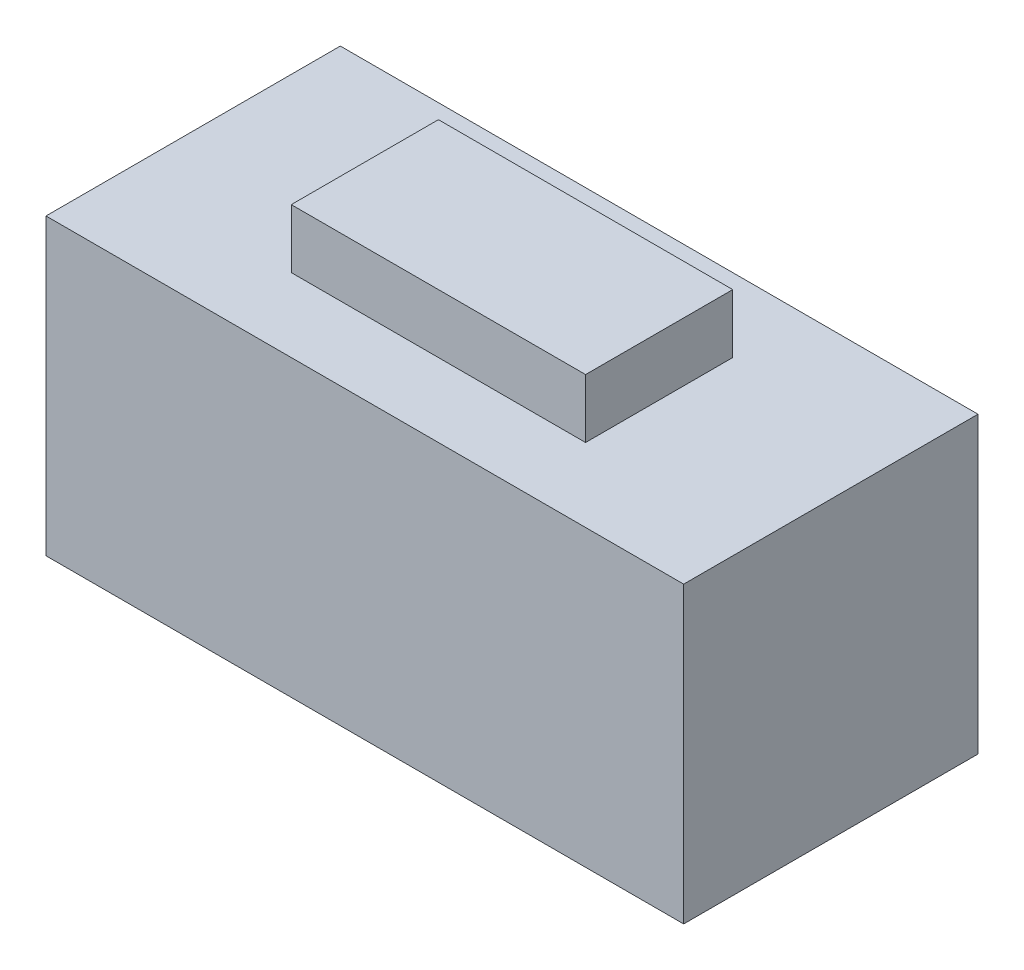
ISO-10303-21;
HEADER;
FILE_DESCRIPTION(('STEP AP214'),'2;1');
FILE_NAME('part.step','',(''),(''),'','','');
FILE_SCHEMA(('AUTOMOTIVE_DESIGN { 1 0 10303 214 1 1 1 1 }'));
ENDSEC;
DATA;
#1=APPLICATION_CONTEXT('core data for automotive mechanical design processes');
#2=APPLICATION_PROTOCOL_DEFINITION('international standard','automotive_design',2000,#1);
#3=PRODUCT_CONTEXT('',#1,'mechanical');
#4=PRODUCT('Part','Part','',(#3));
#5=PRODUCT_RELATED_PRODUCT_CATEGORY('part','',(#4));
#6=PRODUCT_DEFINITION_FORMATION('','',#4);
#7=PRODUCT_DEFINITION_CONTEXT('part definition',#1,'design');
#8=PRODUCT_DEFINITION('design','',#6,#7);
#9=PRODUCT_DEFINITION_SHAPE('','',#8);
#10=(LENGTH_UNIT() NAMED_UNIT(*) SI_UNIT(.MILLI.,.METRE.));
#11=(NAMED_UNIT(*) PLANE_ANGLE_UNIT() SI_UNIT($,.RADIAN.));
#12=(NAMED_UNIT(*) SI_UNIT($,.STERADIAN.) SOLID_ANGLE_UNIT());
#13=UNCERTAINTY_MEASURE_WITH_UNIT(LENGTH_MEASURE(1.E-05),#10,'distance_accuracy_value','');
#14=(GEOMETRIC_REPRESENTATION_CONTEXT(3) GLOBAL_UNCERTAINTY_ASSIGNED_CONTEXT((#13)) GLOBAL_UNIT_ASSIGNED_CONTEXT((#10,
#11,#12)) REPRESENTATION_CONTEXT('',''));
#15=CARTESIAN_POINT('',(0.,0.,0.));
#16=DIRECTION('',(0.,0.,1.));
#17=DIRECTION('',(1.,0.,0.));
#18=AXIS2_PLACEMENT_3D('',#15,#16,#17);
#19=CARTESIAN_POINT('',(-3.25,3.,1.5));
#20=DIRECTION('',(1.,0.,0.));
#21=DIRECTION('',(0.,0.,-1.));
#22=AXIS2_PLACEMENT_3D('',#19,#20,#21);
#23=PLANE('',#22);
#24=DIRECTION('',(0.,0.,1.));
#25=VECTOR('',#24,1.);
#26=CARTESIAN_POINT('',(-3.25,0.,1.5));
#27=LINE('',#26,#25);
#28=CARTESIAN_POINT('',(-3.25,0.,-1.5));
#29=VERTEX_POINT('',#28);
#30=CARTESIAN_POINT('',(-3.25,0.,1.5));
#31=VERTEX_POINT('',#30);
#32=EDGE_CURVE('E120',#29,#31,#27,.T.);
#33=ORIENTED_EDGE('',*,*,#32,.T.);
#34=DIRECTION('',(0.,-1.,0.));
#35=VECTOR('',#34,1.);
#36=CARTESIAN_POINT('',(-3.25,3.,1.5));
#37=LINE('',#36,#35);
#38=CARTESIAN_POINT('',(-3.25,3.,1.5));
#39=VERTEX_POINT('',#38);
#40=EDGE_CURVE('E11',#39,#31,#37,.T.);
#41=ORIENTED_EDGE('',*,*,#40,.F.);
#42=DIRECTION('',(0.,0.,1.));
#43=VECTOR('',#42,1.);
#44=CARTESIAN_POINT('',(-3.25,3.,1.5));
#45=LINE('',#44,#43);
#46=CARTESIAN_POINT('',(-3.25,3.,-1.5));
#47=VERTEX_POINT('',#46);
#48=EDGE_CURVE('E129',#47,#39,#45,.T.);
#49=ORIENTED_EDGE('',*,*,#48,.F.);
#50=DIRECTION('',(0.,-1.,0.));
#51=VECTOR('',#50,1.);
#52=CARTESIAN_POINT('',(-3.25,3.,-1.5));
#53=LINE('',#52,#51);
#54=EDGE_CURVE('E138',#47,#29,#53,.T.);
#55=ORIENTED_EDGE('',*,*,#54,.T.);
#56=EDGE_LOOP('',(#33,#41,#49,#55));
#57=FACE_BOUND('',#56,.T.);
#58=ADVANCED_FACE('F36',(#57),#23,.F.);
#59=CARTESIAN_POINT('',(3.25,3.,1.5));
#60=DIRECTION('',(0.,0.,-1.));
#61=DIRECTION('',(-1.,0.,0.));
#62=AXIS2_PLACEMENT_3D('',#59,#60,#61);
#63=PLANE('',#62);
#64=DIRECTION('',(1.,0.,0.));
#65=VECTOR('',#64,1.);
#66=CARTESIAN_POINT('',(3.25,0.,1.5));
#67=LINE('',#66,#65);
#68=CARTESIAN_POINT('',(3.25,0.,1.5));
#69=VERTEX_POINT('',#68);
#70=EDGE_CURVE('E123',#31,#69,#67,.T.);
#71=ORIENTED_EDGE('',*,*,#70,.T.);
#72=DIRECTION('',(0.,-1.,0.));
#73=VECTOR('',#72,1.);
#74=CARTESIAN_POINT('',(3.25,3.,1.5));
#75=LINE('',#74,#73);
#76=CARTESIAN_POINT('',(3.25,3.,1.5));
#77=VERTEX_POINT('',#76);
#78=EDGE_CURVE('E43',#77,#69,#75,.T.);
#79=ORIENTED_EDGE('',*,*,#78,.F.);
#80=DIRECTION('',(1.,0.,0.));
#81=VECTOR('',#80,1.);
#82=CARTESIAN_POINT('',(3.25,3.,1.5));
#83=LINE('',#82,#81);
#84=EDGE_CURVE('E132',#39,#77,#83,.T.);
#85=ORIENTED_EDGE('',*,*,#84,.F.);
#86=ORIENTED_EDGE('',*,*,#40,.T.);
#87=EDGE_LOOP('',(#71,#79,#85,#86));
#88=FACE_BOUND('',#87,.T.);
#89=ADVANCED_FACE('F169',(#88),#63,.F.);
#90=CARTESIAN_POINT('',(3.25,3.,1.5));
#91=DIRECTION('',(-1.,0.,0.));
#92=DIRECTION('',(0.,0.,1.));
#93=AXIS2_PLACEMENT_3D('',#90,#91,#92);
#94=PLANE('',#93);
#95=DIRECTION('',(0.,0.,-1.));
#96=VECTOR('',#95,1.);
#97=CARTESIAN_POINT('',(3.25,0.,1.5));
#98=LINE('',#97,#96);
#99=CARTESIAN_POINT('',(3.25,0.,-1.5));
#100=VERTEX_POINT('',#99);
#101=EDGE_CURVE('E141',#69,#100,#98,.T.);
#102=ORIENTED_EDGE('',*,*,#101,.T.);
#103=DIRECTION('',(0.,-1.,0.));
#104=VECTOR('',#103,1.);
#105=CARTESIAN_POINT('',(3.25,3.,-1.5));
#106=LINE('',#105,#104);
#107=CARTESIAN_POINT('',(3.25,3.,-1.5));
#108=VERTEX_POINT('',#107);
#109=EDGE_CURVE('E146',#108,#100,#106,.T.);
#110=ORIENTED_EDGE('',*,*,#109,.F.);
#111=DIRECTION('',(0.,0.,-1.));
#112=VECTOR('',#111,1.);
#113=CARTESIAN_POINT('',(3.25,3.,1.5));
#114=LINE('',#113,#112);
#115=EDGE_CURVE('E135',#77,#108,#114,.T.);
#116=ORIENTED_EDGE('',*,*,#115,.F.);
#117=ORIENTED_EDGE('',*,*,#78,.T.);
#118=EDGE_LOOP('',(#102,#110,#116,#117));
#119=FACE_BOUND('',#118,.T.);
#120=ADVANCED_FACE('F153',(#119),#94,.F.);
#121=CARTESIAN_POINT('',(3.25,3.,-1.5));
#122=DIRECTION('',(0.,0.,1.));
#123=DIRECTION('',(1.,0.,0.));
#124=AXIS2_PLACEMENT_3D('',#121,#122,#123);
#125=PLANE('',#124);
#126=DIRECTION('',(-1.,0.,0.));
#127=VECTOR('',#126,1.);
#128=CARTESIAN_POINT('',(3.25,0.,-1.5));
#129=LINE('',#128,#127);
#130=EDGE_CURVE('E133',#100,#29,#129,.T.);
#131=ORIENTED_EDGE('',*,*,#130,.T.);
#132=ORIENTED_EDGE('',*,*,#54,.F.);
#133=DIRECTION('',(-1.,0.,0.));
#134=VECTOR('',#133,1.);
#135=CARTESIAN_POINT('',(3.25,3.,-1.5));
#136=LINE('',#135,#134);
#137=EDGE_CURVE('E137',#108,#47,#136,.T.);
#138=ORIENTED_EDGE('',*,*,#137,.F.);
#139=ORIENTED_EDGE('',*,*,#109,.T.);
#140=EDGE_LOOP('',(#131,#132,#138,#139));
#141=FACE_BOUND('',#140,.T.);
#142=ADVANCED_FACE('F162',(#141),#125,.F.);
#143=CARTESIAN_POINT('',(0.,3.,0.));
#144=DIRECTION('',(0.,1.,0.));
#145=DIRECTION('',(0.,0.,1.));
#146=AXIS2_PLACEMENT_3D('',#143,#144,#145);
#147=PLANE('',#146);
#148=DIRECTION('',(0.,0.,1.));
#149=VECTOR('',#148,1.);
#150=CARTESIAN_POINT('',(-1.5,3.,0.75));
#151=LINE('',#150,#149);
#152=CARTESIAN_POINT('',(-1.5,3.,-0.75));
#153=VERTEX_POINT('',#152);
#154=CARTESIAN_POINT('',(-1.5,3.,0.75));
#155=VERTEX_POINT('',#154);
#156=EDGE_CURVE('E50',#153,#155,#151,.T.);
#157=ORIENTED_EDGE('',*,*,#156,.F.);
#158=DIRECTION('',(-1.,0.,0.));
#159=VECTOR('',#158,1.);
#160=CARTESIAN_POINT('',(1.5,3.,-0.75));
#161=LINE('',#160,#159);
#162=CARTESIAN_POINT('',(1.5,3.,-0.75));
#163=VERTEX_POINT('',#162);
#164=EDGE_CURVE('E54',#163,#153,#161,.T.);
#165=ORIENTED_EDGE('',*,*,#164,.F.);
#166=DIRECTION('',(0.,0.,-1.));
#167=VECTOR('',#166,1.);
#168=CARTESIAN_POINT('',(1.5,3.,0.75));
#169=LINE('',#168,#167);
#170=CARTESIAN_POINT('',(1.5,3.,0.75));
#171=VERTEX_POINT('',#170);
#172=EDGE_CURVE('E263',#171,#163,#169,.T.);
#173=ORIENTED_EDGE('',*,*,#172,.F.);
#174=DIRECTION('',(1.,0.,0.));
#175=VECTOR('',#174,1.);
#176=CARTESIAN_POINT('',(1.5,3.,0.75));
#177=LINE('',#176,#175);
#178=EDGE_CURVE('E269',#155,#171,#177,.T.);
#179=ORIENTED_EDGE('',*,*,#178,.F.);
#180=EDGE_LOOP('',(#157,#165,#173,#179));
#181=FACE_BOUND('',#180,.T.);
#182=ORIENTED_EDGE('',*,*,#48,.T.);
#183=ORIENTED_EDGE('',*,*,#84,.T.);
#184=ORIENTED_EDGE('',*,*,#115,.T.);
#185=ORIENTED_EDGE('',*,*,#137,.T.);
#186=EDGE_LOOP('',(#182,#183,#184,#185));
#187=FACE_BOUND('',#186,.T.);
#188=ADVANCED_FACE('F168',(#181,#187),#147,.T.);
#189=CARTESIAN_POINT('',(0.,0.,0.));
#190=DIRECTION('',(0.,1.,0.));
#191=DIRECTION('',(0.,0.,1.));
#192=AXIS2_PLACEMENT_3D('',#189,#190,#191);
#193=PLANE('',#192);
#194=ORIENTED_EDGE('',*,*,#32,.F.);
#195=ORIENTED_EDGE('',*,*,#130,.F.);
#196=ORIENTED_EDGE('',*,*,#101,.F.);
#197=ORIENTED_EDGE('',*,*,#70,.F.);
#198=EDGE_LOOP('',(#194,#195,#196,#197));
#199=FACE_BOUND('',#198,.T.);
#200=ADVANCED_FACE('F159',(#199),#193,.F.);
#201=CARTESIAN_POINT('',(-1.5,3.6,0.75));
#202=DIRECTION('',(1.,0.,0.));
#203=DIRECTION('',(0.,0.,-1.));
#204=AXIS2_PLACEMENT_3D('',#201,#202,#203);
#205=PLANE('',#204);
#206=ORIENTED_EDGE('',*,*,#156,.T.);
#207=DIRECTION('',(0.,-1.,0.));
#208=VECTOR('',#207,1.);
#209=CARTESIAN_POINT('',(-1.5,3.6,0.75));
#210=LINE('',#209,#208);
#211=CARTESIAN_POINT('',(-1.5,3.6,0.75));
#212=VERTEX_POINT('',#211);
#213=EDGE_CURVE('E103',#212,#155,#210,.T.);
#214=ORIENTED_EDGE('',*,*,#213,.F.);
#215=DIRECTION('',(0.,0.,1.));
#216=VECTOR('',#215,1.);
#217=CARTESIAN_POINT('',(-1.5,3.6,0.75));
#218=LINE('',#217,#216);
#219=CARTESIAN_POINT('',(-1.5,3.6,-0.75));
#220=VERTEX_POINT('',#219);
#221=EDGE_CURVE('E109',#220,#212,#218,.T.);
#222=ORIENTED_EDGE('',*,*,#221,.F.);
#223=DIRECTION('',(0.,-1.,0.));
#224=VECTOR('',#223,1.);
#225=CARTESIAN_POINT('',(-1.5,3.6,-0.75));
#226=LINE('',#225,#224);
#227=EDGE_CURVE('E261',#220,#153,#226,.T.);
#228=ORIENTED_EDGE('',*,*,#227,.T.);
#229=EDGE_LOOP('',(#206,#214,#222,#228));
#230=FACE_BOUND('',#229,.T.);
#231=ADVANCED_FACE('F119',(#230),#205,.F.);
#232=CARTESIAN_POINT('',(1.5,3.6,0.75));
#233=DIRECTION('',(0.,0.,-1.));
#234=DIRECTION('',(-1.,0.,0.));
#235=AXIS2_PLACEMENT_3D('',#232,#233,#234);
#236=PLANE('',#235);
#237=ORIENTED_EDGE('',*,*,#178,.T.);
#238=DIRECTION('',(0.,-1.,0.));
#239=VECTOR('',#238,1.);
#240=CARTESIAN_POINT('',(1.5,3.6,0.75));
#241=LINE('',#240,#239);
#242=CARTESIAN_POINT('',(1.5,3.6,0.75));
#243=VERTEX_POINT('',#242);
#244=EDGE_CURVE('E105',#243,#171,#241,.T.);
#245=ORIENTED_EDGE('',*,*,#244,.F.);
#246=DIRECTION('',(1.,0.,0.));
#247=VECTOR('',#246,1.);
#248=CARTESIAN_POINT('',(1.5,3.6,0.75));
#249=LINE('',#248,#247);
#250=EDGE_CURVE('E98',#212,#243,#249,.T.);
#251=ORIENTED_EDGE('',*,*,#250,.F.);
#252=ORIENTED_EDGE('',*,*,#213,.T.);
#253=EDGE_LOOP('',(#237,#245,#251,#252));
#254=FACE_BOUND('',#253,.T.);
#255=ADVANCED_FACE('F101',(#254),#236,.F.);
#256=CARTESIAN_POINT('',(1.5,3.6,0.75));
#257=DIRECTION('',(-1.,0.,0.));
#258=DIRECTION('',(0.,0.,1.));
#259=AXIS2_PLACEMENT_3D('',#256,#257,#258);
#260=PLANE('',#259);
#261=ORIENTED_EDGE('',*,*,#172,.T.);
#262=DIRECTION('',(0.,-1.,0.));
#263=VECTOR('',#262,1.);
#264=CARTESIAN_POINT('',(1.5,3.6,-0.75));
#265=LINE('',#264,#263);
#266=CARTESIAN_POINT('',(1.5,3.6,-0.75));
#267=VERTEX_POINT('',#266);
#268=EDGE_CURVE('E125',#267,#163,#265,.T.);
#269=ORIENTED_EDGE('',*,*,#268,.F.);
#270=DIRECTION('',(0.,0.,-1.));
#271=VECTOR('',#270,1.);
#272=CARTESIAN_POINT('',(1.5,3.6,0.75));
#273=LINE('',#272,#271);
#274=EDGE_CURVE('E108',#243,#267,#273,.T.);
#275=ORIENTED_EDGE('',*,*,#274,.F.);
#276=ORIENTED_EDGE('',*,*,#244,.T.);
#277=EDGE_LOOP('',(#261,#269,#275,#276));
#278=FACE_BOUND('',#277,.T.);
#279=ADVANCED_FACE('F187',(#278),#260,.F.);
#280=CARTESIAN_POINT('',(1.5,3.6,-0.75));
#281=DIRECTION('',(0.,0.,1.));
#282=DIRECTION('',(1.,0.,0.));
#283=AXIS2_PLACEMENT_3D('',#280,#281,#282);
#284=PLANE('',#283);
#285=ORIENTED_EDGE('',*,*,#164,.T.);
#286=ORIENTED_EDGE('',*,*,#227,.F.);
#287=DIRECTION('',(-1.,0.,0.));
#288=VECTOR('',#287,1.);
#289=CARTESIAN_POINT('',(1.5,3.6,-0.75));
#290=LINE('',#289,#288);
#291=EDGE_CURVE('E114',#267,#220,#290,.T.);
#292=ORIENTED_EDGE('',*,*,#291,.F.);
#293=ORIENTED_EDGE('',*,*,#268,.T.);
#294=EDGE_LOOP('',(#285,#286,#292,#293));
#295=FACE_BOUND('',#294,.T.);
#296=ADVANCED_FACE('F190',(#295),#284,.F.);
#297=CARTESIAN_POINT('',(0.,3.6,0.));
#298=DIRECTION('',(0.,1.,0.));
#299=DIRECTION('',(0.,0.,1.));
#300=AXIS2_PLACEMENT_3D('',#297,#298,#299);
#301=PLANE('',#300);
#302=ORIENTED_EDGE('',*,*,#221,.T.);
#303=ORIENTED_EDGE('',*,*,#250,.T.);
#304=ORIENTED_EDGE('',*,*,#274,.T.);
#305=ORIENTED_EDGE('',*,*,#291,.T.);
#306=EDGE_LOOP('',(#302,#303,#304,#305));
#307=FACE_BOUND('',#306,.T.);
#308=ADVANCED_FACE('F112',(#307),#301,.T.);
#309=CLOSED_SHELL('',(#58,#89,#120,#142,#188,#200,#231,#255,#279,#296,#308));
#310=MANIFOLD_SOLID_BREP('B2',#309);
#311=ADVANCED_BREP_SHAPE_REPRESENTATION('',(#18,#310),#14);
#312=SHAPE_DEFINITION_REPRESENTATION(#9,#311);
ENDSEC;
END-ISO-10303-21;
